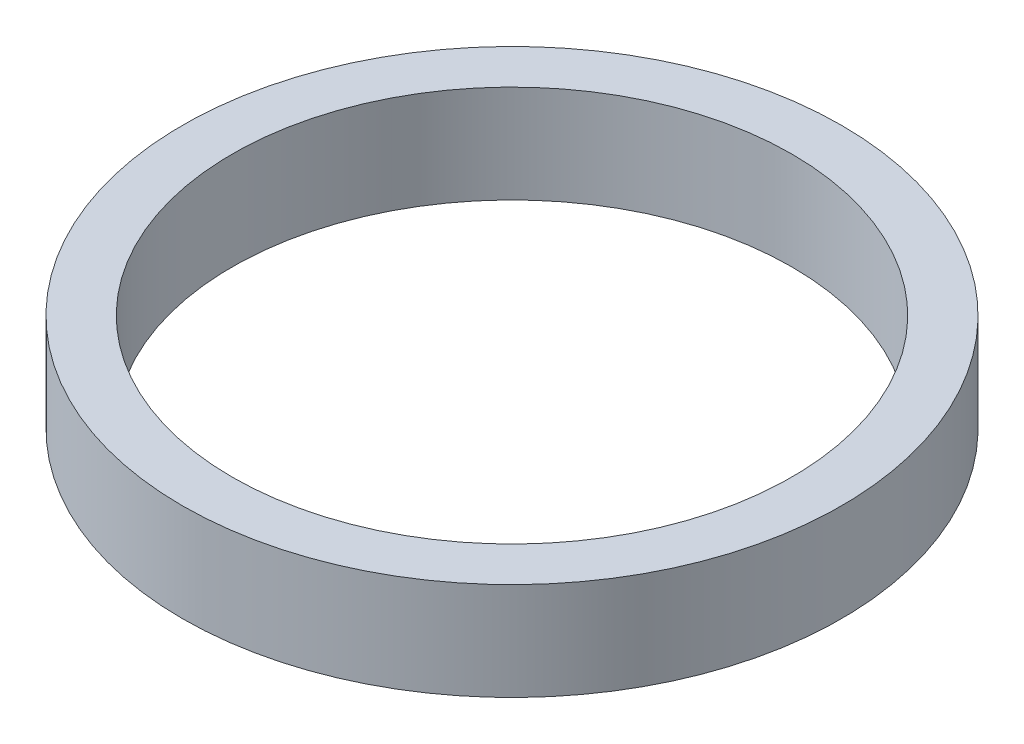
ISO-10303-21;
HEADER;
FILE_DESCRIPTION(('STEP AP214'),'2;1');
FILE_NAME('part.step','',(''),(''),'','','');
FILE_SCHEMA(('AUTOMOTIVE_DESIGN { 1 0 10303 214 1 1 1 1 }'));
ENDSEC;
DATA;
#1=APPLICATION_CONTEXT('core data for automotive mechanical design processes');
#2=APPLICATION_PROTOCOL_DEFINITION('international standard','automotive_design',2000,#1);
#3=PRODUCT_CONTEXT('',#1,'mechanical');
#4=PRODUCT('Part','Part','',(#3));
#5=PRODUCT_RELATED_PRODUCT_CATEGORY('part','',(#4));
#6=PRODUCT_DEFINITION_FORMATION('','',#4);
#7=PRODUCT_DEFINITION_CONTEXT('part definition',#1,'design');
#8=PRODUCT_DEFINITION('design','',#6,#7);
#9=PRODUCT_DEFINITION_SHAPE('','',#8);
#10=(LENGTH_UNIT() NAMED_UNIT(*) SI_UNIT(.MILLI.,.METRE.));
#11=(NAMED_UNIT(*) PLANE_ANGLE_UNIT() SI_UNIT($,.RADIAN.));
#12=(NAMED_UNIT(*) SI_UNIT($,.STERADIAN.) SOLID_ANGLE_UNIT());
#13=UNCERTAINTY_MEASURE_WITH_UNIT(LENGTH_MEASURE(1.E-05),#10,'distance_accuracy_value','');
#14=(GEOMETRIC_REPRESENTATION_CONTEXT(3) GLOBAL_UNCERTAINTY_ASSIGNED_CONTEXT((#13)) GLOBAL_UNIT_ASSIGNED_CONTEXT((#10,
#11,#12)) REPRESENTATION_CONTEXT('',''));
#15=CARTESIAN_POINT('',(0.,0.,0.));
#16=DIRECTION('',(0.,0.,1.));
#17=DIRECTION('',(1.,0.,0.));
#18=AXIS2_PLACEMENT_3D('',#15,#16,#17);
#19=CARTESIAN_POINT('',(0.,5.8,0.));
#20=DIRECTION('',(0.,1.,0.));
#21=DIRECTION('',(0.,0.,1.));
#22=AXIS2_PLACEMENT_3D('',#19,#20,#21);
#23=PLANE('',#22);
#24=CARTESIAN_POINT('',(0.,5.8,0.));
#25=DIRECTION('',(0.,1.,0.));
#26=DIRECTION('',(0.,0.,1.));
#27=AXIS2_PLACEMENT_3D('',#24,#25,#26);
#28=CIRCLE('',#27,19.55);
#29=CARTESIAN_POINT('',(0.,5.8,19.55));
#30=VERTEX_POINT('',#29);
#31=EDGE_CURVE('E10',#30,#30,#28,.T.);
#32=ORIENTED_EDGE('',*,*,#31,.T.);
#33=EDGE_LOOP('',(#32));
#34=FACE_BOUND('',#33,.T.);
#35=CARTESIAN_POINT('',(0.,5.8,0.));
#36=DIRECTION('',(0.,1.,0.));
#37=DIRECTION('',(0.,0.,1.));
#38=AXIS2_PLACEMENT_3D('',#35,#36,#37);
#39=CIRCLE('',#38,16.6);
#40=CARTESIAN_POINT('',(0.,5.8,16.6));
#41=VERTEX_POINT('',#40);
#42=EDGE_CURVE('E50',#41,#41,#39,.T.);
#43=ORIENTED_EDGE('',*,*,#42,.F.);
#44=EDGE_LOOP('',(#43));
#45=FACE_BOUND('',#44,.T.);
#46=ADVANCED_FACE('F37',(#34,#45),#23,.T.);
#47=CARTESIAN_POINT('',(0.,0.,0.));
#48=DIRECTION('',(0.,1.,0.));
#49=DIRECTION('',(0.,0.,1.));
#50=AXIS2_PLACEMENT_3D('',#47,#48,#49);
#51=PLANE('',#50);
#52=CARTESIAN_POINT('',(0.,0.,0.));
#53=DIRECTION('',(0.,1.,0.));
#54=DIRECTION('',(0.,0.,1.));
#55=AXIS2_PLACEMENT_3D('',#52,#53,#54);
#56=CIRCLE('',#55,19.55);
#57=CARTESIAN_POINT('',(0.,0.,19.55));
#58=VERTEX_POINT('',#57);
#59=EDGE_CURVE('E41',#58,#58,#56,.T.);
#60=ORIENTED_EDGE('',*,*,#59,.F.);
#61=EDGE_LOOP('',(#60));
#62=FACE_BOUND('',#61,.T.);
#63=CARTESIAN_POINT('',(0.,0.,0.));
#64=DIRECTION('',(0.,1.,0.));
#65=DIRECTION('',(0.,0.,1.));
#66=AXIS2_PLACEMENT_3D('',#63,#64,#65);
#67=CIRCLE('',#66,16.6);
#68=CARTESIAN_POINT('',(0.,0.,16.6));
#69=VERTEX_POINT('',#68);
#70=EDGE_CURVE('E52',#69,#69,#67,.T.);
#71=ORIENTED_EDGE('',*,*,#70,.T.);
#72=EDGE_LOOP('',(#71));
#73=FACE_BOUND('',#72,.T.);
#74=ADVANCED_FACE('F64',(#62,#73),#51,.F.);
#75=CARTESIAN_POINT('',(0.,5.8,0.));
#76=DIRECTION('',(0.,-1.,0.));
#77=DIRECTION('',(0.,0.,-1.));
#78=AXIS2_PLACEMENT_3D('',#75,#76,#77);
#79=CYLINDRICAL_SURFACE('',#78,19.55);
#80=ORIENTED_EDGE('',*,*,#31,.F.);
#81=EDGE_LOOP('',(#80));
#82=FACE_BOUND('',#81,.T.);
#83=ORIENTED_EDGE('',*,*,#59,.T.);
#84=EDGE_LOOP('',(#83));
#85=FACE_BOUND('',#84,.T.);
#86=ADVANCED_FACE('F39',(#82,#85),#79,.T.);
#87=CARTESIAN_POINT('',(0.,5.8,0.));
#88=DIRECTION('',(0.,-1.,0.));
#89=DIRECTION('',(0.,0.,-1.));
#90=AXIS2_PLACEMENT_3D('',#87,#88,#89);
#91=CYLINDRICAL_SURFACE('',#90,16.6);
#92=ORIENTED_EDGE('',*,*,#42,.T.);
#93=EDGE_LOOP('',(#92));
#94=FACE_BOUND('',#93,.T.);
#95=ORIENTED_EDGE('',*,*,#70,.F.);
#96=EDGE_LOOP('',(#95));
#97=FACE_BOUND('',#96,.T.);
#98=ADVANCED_FACE('F60',(#94,#97),#91,.F.);
#99=CLOSED_SHELL('',(#46,#74,#86,#98));
#100=MANIFOLD_SOLID_BREP('B2',#99);
#101=ADVANCED_BREP_SHAPE_REPRESENTATION('',(#18,#100),#14);
#102=SHAPE_DEFINITION_REPRESENTATION(#9,#101);
ENDSEC;
END-ISO-10303-21;
